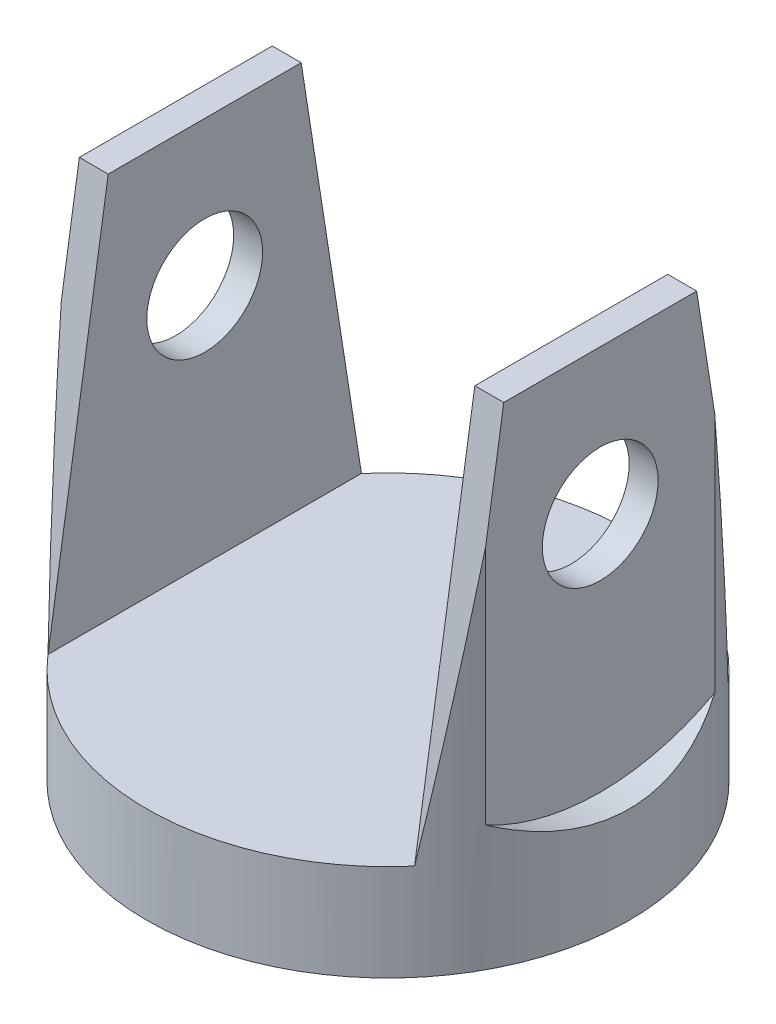
ISO-10303-21;
HEADER;
FILE_DESCRIPTION(('STEP AP214'),'2;1');
FILE_NAME('part.step','',(''),(''),'','','');
FILE_SCHEMA(('AUTOMOTIVE_DESIGN { 1 0 10303 214 1 1 1 1 }'));
ENDSEC;
DATA;
#1=APPLICATION_CONTEXT('core data for automotive mechanical design processes');
#2=APPLICATION_PROTOCOL_DEFINITION('international standard','automotive_design',2000,#1);
#3=PRODUCT_CONTEXT('',#1,'mechanical');
#4=PRODUCT('Part','Part','',(#3));
#5=PRODUCT_RELATED_PRODUCT_CATEGORY('part','',(#4));
#6=PRODUCT_DEFINITION_FORMATION('','',#4);
#7=PRODUCT_DEFINITION_CONTEXT('part definition',#1,'design');
#8=PRODUCT_DEFINITION('design','',#6,#7);
#9=PRODUCT_DEFINITION_SHAPE('','',#8);
#10=(LENGTH_UNIT() NAMED_UNIT(*) SI_UNIT(.MILLI.,.METRE.));
#11=(NAMED_UNIT(*) PLANE_ANGLE_UNIT() SI_UNIT($,.RADIAN.));
#12=(NAMED_UNIT(*) SI_UNIT($,.STERADIAN.) SOLID_ANGLE_UNIT());
#13=UNCERTAINTY_MEASURE_WITH_UNIT(LENGTH_MEASURE(1.E-05),#10,'distance_accuracy_value','');
#14=(GEOMETRIC_REPRESENTATION_CONTEXT(3) GLOBAL_UNCERTAINTY_ASSIGNED_CONTEXT((#13)) GLOBAL_UNIT_ASSIGNED_CONTEXT((#10,
#11,#12)) REPRESENTATION_CONTEXT('',''));
#15=CARTESIAN_POINT('',(0.,0.,0.));
#16=DIRECTION('',(0.,0.,1.));
#17=DIRECTION('',(1.,0.,0.));
#18=AXIS2_PLACEMENT_3D('',#15,#16,#17);
#19=CARTESIAN_POINT('',(0.,0.,0.));
#20=DIRECTION('',(0.,1.,0.));
#21=DIRECTION('',(0.,0.,1.));
#22=AXIS2_PLACEMENT_3D('',#19,#20,#21);
#23=PLANE('',#22);
#24=CARTESIAN_POINT('',(0.,0.,0.));
#25=DIRECTION('',(0.,1.,0.));
#26=DIRECTION('',(0.,0.,1.));
#27=AXIS2_PLACEMENT_3D('',#24,#25,#26);
#28=CIRCLE('',#27,125.);
#29=CARTESIAN_POINT('',(0.,0.,125.));
#30=VERTEX_POINT('',#29);
#31=EDGE_CURVE('E181',#30,#30,#28,.T.);
#32=ORIENTED_EDGE('',*,*,#31,.F.);
#33=EDGE_LOOP('',(#32));
#34=FACE_BOUND('',#33,.T.);
#35=CARTESIAN_POINT('',(0.,0.,0.));
#36=DIRECTION('',(0.,1.,0.));
#37=DIRECTION('',(0.,0.,1.));
#38=AXIS2_PLACEMENT_3D('',#35,#36,#37);
#39=CIRCLE('',#38,59.95);
#40=CARTESIAN_POINT('',(0.,0.,59.95));
#41=VERTEX_POINT('',#40);
#42=EDGE_CURVE('E11',#41,#41,#39,.F.);
#43=ORIENTED_EDGE('',*,*,#42,.F.);
#44=EDGE_LOOP('',(#43));
#45=FACE_BOUND('',#44,.T.);
#46=ADVANCED_FACE('F34',(#34,#45),#23,.F.);
#47=CARTESIAN_POINT('',(0.,250.,0.));
#48=DIRECTION('',(0.,1.,0.));
#49=DIRECTION('',(0.,0.,1.));
#50=AXIS2_PLACEMENT_3D('',#47,#48,#49);
#51=PLANE('',#50);
#52=DIRECTION('',(0.,0.,1.));
#53=VECTOR('',#52,1.);
#54=CARTESIAN_POINT('',(110.,250.,0.));
#55=LINE('',#54,#53);
#56=CARTESIAN_POINT('',(110.,250.,-50.));
#57=VERTEX_POINT('',#56);
#58=CARTESIAN_POINT('',(110.,250.,50.));
#59=VERTEX_POINT('',#58);
#60=EDGE_CURVE('E125',#57,#59,#55,.T.);
#61=ORIENTED_EDGE('',*,*,#60,.F.);
#62=DIRECTION('',(1.,0.,0.));
#63=VECTOR('',#62,1.);
#64=CARTESIAN_POINT('',(-125.,250.,-50.));
#65=LINE('',#64,#63);
#66=CARTESIAN_POINT('',(95.,250.,-50.));
#67=VERTEX_POINT('',#66);
#68=EDGE_CURVE('E155',#67,#57,#65,.T.);
#69=ORIENTED_EDGE('',*,*,#68,.F.);
#70=DIRECTION('',(0.,0.,-1.));
#71=VECTOR('',#70,1.);
#72=CARTESIAN_POINT('',(95.,250.,0.));
#73=LINE('',#72,#71);
#74=CARTESIAN_POINT('',(95.,250.,50.));
#75=VERTEX_POINT('',#74);
#76=EDGE_CURVE('E187',#75,#67,#73,.T.);
#77=ORIENTED_EDGE('',*,*,#76,.F.);
#78=DIRECTION('',(1.,0.,0.));
#79=VECTOR('',#78,1.);
#80=CARTESIAN_POINT('',(-125.,250.,50.));
#81=LINE('',#80,#79);
#82=EDGE_CURVE('E164',#75,#59,#81,.T.);
#83=ORIENTED_EDGE('',*,*,#82,.T.);
#84=EDGE_LOOP('',(#61,#69,#77,#83));
#85=FACE_BOUND('',#84,.T.);
#86=ADVANCED_FACE('F223',(#85),#51,.T.);
#87=CARTESIAN_POINT('',(0.,250.,0.));
#88=DIRECTION('',(0.,-1.,0.));
#89=DIRECTION('',(0.,0.,-1.));
#90=AXIS2_PLACEMENT_3D('',#87,#88,#89);
#91=CYLINDRICAL_SURFACE('',#90,125.);
#92=ORIENTED_EDGE('',*,*,#31,.T.);
#93=EDGE_LOOP('',(#92));
#94=FACE_BOUND('',#93,.T.);
#95=CARTESIAN_POINT('',(0.,570.098497674048,0.));
#96=DIRECTION('',(0.,0.154330508485288,-0.98801927822825));
#97=DIRECTION('',(0.,-0.98801927822825,-0.154330508485288));
#98=AXIS2_PLACEMENT_3D('',#95,#96,#97);
#99=ELLIPSE('',#98,809.950030145311,125.);
#100=CARTESIAN_POINT('',(110.,190.002591381192,-59.3717104351896));
#101=VERTEX_POINT('',#100);
#102=CARTESIAN_POINT('',(95.,50.,-81.2403840463596));
#103=VERTEX_POINT('',#102);
#104=EDGE_CURVE('E124',#101,#103,#99,.T.);
#105=ORIENTED_EDGE('',*,*,#104,.F.);
#106=DIRECTION('',(0.,-1.,0.));
#107=VECTOR('',#106,1.);
#108=CARTESIAN_POINT('',(110.,250.,-59.3717104351896));
#109=LINE('',#108,#107);
#110=CARTESIAN_POINT('',(110.,65.,-59.3717104351896));
#111=VERTEX_POINT('',#110);
#112=EDGE_CURVE('E49',#101,#111,#109,.T.);
#113=ORIENTED_EDGE('',*,*,#112,.T.);
#114=CARTESIAN_POINT('',(0.,175.,0.));
#115=DIRECTION('',(-0.707106781186547,-0.707106781186548,0.));
#116=DIRECTION('',(0.707106781186547,-0.707106781186548,0.));
#117=AXIS2_PLACEMENT_3D('',#114,#115,#116);
#118=ELLIPSE('',#117,176.776695296637,125.);
#119=CARTESIAN_POINT('',(110.,65.,59.3717104351896));
#120=VERTEX_POINT('',#119);
#121=EDGE_CURVE('E42',#120,#111,#118,.F.);
#122=ORIENTED_EDGE('',*,*,#121,.F.);
#123=DIRECTION('',(0.,-1.,0.));
#124=VECTOR('',#123,1.);
#125=CARTESIAN_POINT('',(110.,250.,59.3717104351896));
#126=LINE('',#125,#124);
#127=CARTESIAN_POINT('',(110.,190.002591381192,59.3717104351896));
#128=VERTEX_POINT('',#127);
#129=EDGE_CURVE('E118',#120,#128,#126,.F.);
#130=ORIENTED_EDGE('',*,*,#129,.T.);
#131=CARTESIAN_POINT('',(0.,570.098497674048,0.));
#132=DIRECTION('',(0.,-0.154330508485288,-0.98801927822825));
#133=DIRECTION('',(0.,-0.98801927822825,0.154330508485288));
#134=AXIS2_PLACEMENT_3D('',#131,#132,#133);
#135=ELLIPSE('',#134,809.950030145311,125.);
#136=CARTESIAN_POINT('',(95.,50.,81.2403840463596));
#137=VERTEX_POINT('',#136);
#138=EDGE_CURVE('E172',#128,#137,#135,.T.);
#139=ORIENTED_EDGE('',*,*,#138,.T.);
#140=CARTESIAN_POINT('',(0.,50.,0.));
#141=DIRECTION('',(0.,1.,0.));
#142=DIRECTION('',(0.,0.,1.));
#143=AXIS2_PLACEMENT_3D('',#140,#141,#142);
#144=CIRCLE('',#143,125.);
#145=CARTESIAN_POINT('',(-95.,50.,81.2403840463596));
#146=VERTEX_POINT('',#145);
#147=EDGE_CURVE('E190',#146,#137,#144,.T.);
#148=ORIENTED_EDGE('',*,*,#147,.F.);
#149=CARTESIAN_POINT('',(-110.,190.002591381192,59.3717104351896));
#150=VERTEX_POINT('',#149);
#151=EDGE_CURVE('E168',#146,#150,#135,.T.);
#152=ORIENTED_EDGE('',*,*,#151,.T.);
#153=DIRECTION('',(0.,-1.,0.));
#154=VECTOR('',#153,1.);
#155=CARTESIAN_POINT('',(-110.,250.,59.3717104351896));
#156=LINE('',#155,#154);
#157=CARTESIAN_POINT('',(-110.,65.,59.3717104351896));
#158=VERTEX_POINT('',#157);
#159=EDGE_CURVE('E148',#150,#158,#156,.T.);
#160=ORIENTED_EDGE('',*,*,#159,.T.);
#161=CARTESIAN_POINT('',(0.,175.,0.));
#162=DIRECTION('',(0.707106781186547,-0.707106781186548,0.));
#163=DIRECTION('',(-0.707106781186547,-0.707106781186548,0.));
#164=AXIS2_PLACEMENT_3D('',#161,#162,#163);
#165=ELLIPSE('',#164,176.776695296637,125.);
#166=CARTESIAN_POINT('',(-110.,65.,-59.3717104351896));
#167=VERTEX_POINT('',#166);
#168=EDGE_CURVE('E116',#167,#158,#165,.F.);
#169=ORIENTED_EDGE('',*,*,#168,.F.);
#170=DIRECTION('',(0.,-1.,0.));
#171=VECTOR('',#170,1.);
#172=CARTESIAN_POINT('',(-110.,250.,-59.3717104351896));
#173=LINE('',#172,#171);
#174=CARTESIAN_POINT('',(-110.,190.002591381192,-59.3717104351896));
#175=VERTEX_POINT('',#174);
#176=EDGE_CURVE('E142',#167,#175,#173,.F.);
#177=ORIENTED_EDGE('',*,*,#176,.T.);
#178=CARTESIAN_POINT('',(-95.,50.,-81.2403840463596));
#179=VERTEX_POINT('',#178);
#180=EDGE_CURVE('E159',#179,#175,#99,.T.);
#181=ORIENTED_EDGE('',*,*,#180,.F.);
#182=EDGE_CURVE('E193',#103,#179,#144,.T.);
#183=ORIENTED_EDGE('',*,*,#182,.F.);
#184=EDGE_LOOP('',(#105,#113,#122,#130,#139,#148,#152,#160,#169,#177,#181,#183));
#185=FACE_BOUND('',#184,.T.);
#186=ADVANCED_FACE('F36',(#94,#185),#91,.T.);
#187=DIRECTION('',(0.,0.,-1.));
#188=VECTOR('',#187,1.);
#189=CARTESIAN_POINT('',(-110.,250.,0.));
#190=LINE('',#189,#188);
#191=CARTESIAN_POINT('',(-110.,250.,50.));
#192=VERTEX_POINT('',#191);
#193=CARTESIAN_POINT('',(-110.,250.,-50.));
#194=VERTEX_POINT('',#193);
#195=EDGE_CURVE('E57',#192,#194,#190,.T.);
#196=ORIENTED_EDGE('',*,*,#195,.F.);
#197=CARTESIAN_POINT('',(-95.,250.,50.));
#198=VERTEX_POINT('',#197);
#199=EDGE_CURVE('E167',#192,#198,#81,.T.);
#200=ORIENTED_EDGE('',*,*,#199,.T.);
#201=DIRECTION('',(0.,0.,1.));
#202=VECTOR('',#201,1.);
#203=CARTESIAN_POINT('',(-95.,250.,0.));
#204=LINE('',#203,#202);
#205=CARTESIAN_POINT('',(-95.,250.,-50.));
#206=VERTEX_POINT('',#205);
#207=EDGE_CURVE('E184',#206,#198,#204,.T.);
#208=ORIENTED_EDGE('',*,*,#207,.F.);
#209=EDGE_CURVE('E158',#194,#206,#65,.T.);
#210=ORIENTED_EDGE('',*,*,#209,.F.);
#211=EDGE_LOOP('',(#196,#200,#208,#210));
#212=FACE_BOUND('',#211,.T.);
#213=ADVANCED_FACE('F230',(#212),#51,.T.);
#214=CARTESIAN_POINT('',(95.,50.,-125.));
#215=DIRECTION('',(1.,0.,0.));
#216=DIRECTION('',(0.,0.,-1.));
#217=AXIS2_PLACEMENT_3D('',#214,#215,#216);
#218=PLANE('',#217);
#219=CARTESIAN_POINT('',(95.,175.,0.));
#220=DIRECTION('',(1.,0.,0.));
#221=DIRECTION('',(0.,0.,-1.));
#222=AXIS2_PLACEMENT_3D('',#219,#220,#221);
#223=CIRCLE('',#222,30.);
#224=CARTESIAN_POINT('',(95.,175.,-30.));
#225=VERTEX_POINT('',#224);
#226=EDGE_CURVE('E152',#225,#225,#223,.T.);
#227=ORIENTED_EDGE('',*,*,#226,.T.);
#228=EDGE_LOOP('',(#227));
#229=FACE_BOUND('',#228,.T.);
#230=DIRECTION('',(0.,0.98801927822825,0.154330508485288));
#231=VECTOR('',#230,1.);
#232=CARTESIAN_POINT('',(95.,43.327467349698,-82.2826464591462));
#233=LINE('',#232,#231);
#234=EDGE_CURVE('E162',#103,#67,#233,.T.);
#235=ORIENTED_EDGE('',*,*,#234,.F.);
#236=DIRECTION('',(0.,0.,-1.));
#237=VECTOR('',#236,1.);
#238=CARTESIAN_POINT('',(95.,50.,-125.));
#239=LINE('',#238,#237);
#240=EDGE_CURVE('E175',#137,#103,#239,.T.);
#241=ORIENTED_EDGE('',*,*,#240,.F.);
#242=DIRECTION('',(0.,0.98801927822825,-0.154330508485288));
#243=VECTOR('',#242,1.);
#244=CARTESIAN_POINT('',(95.,81.4478467502562,76.3281699968143));
#245=LINE('',#244,#243);
#246=EDGE_CURVE('E171',#137,#75,#245,.T.);
#247=ORIENTED_EDGE('',*,*,#246,.T.);
#248=ORIENTED_EDGE('',*,*,#76,.T.);
#249=EDGE_LOOP('',(#235,#241,#247,#248));
#250=FACE_BOUND('',#249,.T.);
#251=ADVANCED_FACE('F234',(#229,#250),#218,.F.);
#252=CARTESIAN_POINT('',(-95.,50.,-125.));
#253=DIRECTION('',(-1.,0.,0.));
#254=DIRECTION('',(0.,0.,1.));
#255=AXIS2_PLACEMENT_3D('',#252,#253,#254);
#256=PLANE('',#255);
#257=CARTESIAN_POINT('',(-95.,175.,0.));
#258=DIRECTION('',(-1.,0.,0.));
#259=DIRECTION('',(0.,0.,1.));
#260=AXIS2_PLACEMENT_3D('',#257,#258,#259);
#261=CIRCLE('',#260,30.);
#262=CARTESIAN_POINT('',(-95.,175.,30.));
#263=VERTEX_POINT('',#262);
#264=EDGE_CURVE('E151',#263,#263,#261,.T.);
#265=ORIENTED_EDGE('',*,*,#264,.T.);
#266=EDGE_LOOP('',(#265));
#267=FACE_BOUND('',#266,.T.);
#268=DIRECTION('',(0.,-0.98801927822825,-0.154330508485288));
#269=VECTOR('',#268,1.);
#270=CARTESIAN_POINT('',(-95.,43.327467349698,-82.2826464591462));
#271=LINE('',#270,#269);
#272=EDGE_CURVE('E197',#206,#179,#271,.T.);
#273=ORIENTED_EDGE('',*,*,#272,.F.);
#274=ORIENTED_EDGE('',*,*,#207,.T.);
#275=DIRECTION('',(0.,-0.98801927822825,0.154330508485288));
#276=VECTOR('',#275,1.);
#277=CARTESIAN_POINT('',(-95.,81.4478467502562,76.3281699968143));
#278=LINE('',#277,#276);
#279=EDGE_CURVE('E194',#198,#146,#278,.T.);
#280=ORIENTED_EDGE('',*,*,#279,.T.);
#281=DIRECTION('',(0.,0.,1.));
#282=VECTOR('',#281,1.);
#283=CARTESIAN_POINT('',(-95.,50.,-125.));
#284=LINE('',#283,#282);
#285=EDGE_CURVE('E178',#179,#146,#284,.T.);
#286=ORIENTED_EDGE('',*,*,#285,.F.);
#287=EDGE_LOOP('',(#273,#274,#280,#286));
#288=FACE_BOUND('',#287,.T.);
#289=ADVANCED_FACE('F237',(#267,#288),#256,.F.);
#290=CARTESIAN_POINT('',(0.,50.,0.));
#291=DIRECTION('',(0.,1.,0.));
#292=DIRECTION('',(0.,0.,1.));
#293=AXIS2_PLACEMENT_3D('',#290,#291,#292);
#294=PLANE('',#293);
#295=ORIENTED_EDGE('',*,*,#182,.T.);
#296=ORIENTED_EDGE('',*,*,#285,.T.);
#297=ORIENTED_EDGE('',*,*,#147,.T.);
#298=ORIENTED_EDGE('',*,*,#240,.T.);
#299=EDGE_LOOP('',(#295,#296,#297,#298));
#300=FACE_BOUND('',#299,.T.);
#301=ADVANCED_FACE('F241',(#300),#294,.T.);
#302=CARTESIAN_POINT('',(-125.,13.5785523424435,86.9294841080919));
#303=DIRECTION('',(0.,-0.154330508485288,-0.98801927822825));
#304=DIRECTION('',(0.,0.98801927822825,-0.154330508485288));
#305=AXIS2_PLACEMENT_3D('',#302,#303,#304);
#306=PLANE('',#305);
#307=ORIENTED_EDGE('',*,*,#199,.F.);
#308=DIRECTION('',(0.,-0.98801927822825,0.154330508485288));
#309=VECTOR('',#308,1.);
#310=CARTESIAN_POINT('',(-110.,13.5785523424435,86.9294841080919));
#311=LINE('',#310,#309);
#312=EDGE_CURVE('E145',#192,#150,#311,.T.);
#313=ORIENTED_EDGE('',*,*,#312,.T.);
#314=ORIENTED_EDGE('',*,*,#151,.F.);
#315=ORIENTED_EDGE('',*,*,#279,.F.);
#316=EDGE_LOOP('',(#307,#313,#314,#315));
#317=FACE_BOUND('',#316,.T.);
#318=ADVANCED_FACE('F245',(#317),#306,.F.);
#319=ORIENTED_EDGE('',*,*,#138,.F.);
#320=DIRECTION('',(0.,0.98801927822825,-0.154330508485288));
#321=VECTOR('',#320,1.);
#322=CARTESIAN_POINT('',(110.,13.5785523424435,86.9294841080919));
#323=LINE('',#322,#321);
#324=EDGE_CURVE('E128',#128,#59,#323,.T.);
#325=ORIENTED_EDGE('',*,*,#324,.T.);
#326=ORIENTED_EDGE('',*,*,#82,.F.);
#327=ORIENTED_EDGE('',*,*,#246,.F.);
#328=EDGE_LOOP('',(#319,#325,#326,#327));
#329=FACE_BOUND('',#328,.T.);
#330=ADVANCED_FACE('F247',(#329),#306,.F.);
#331=CARTESIAN_POINT('',(-125.,13.5785523424435,-86.9294841080919));
#332=DIRECTION('',(0.,0.154330508485288,-0.98801927822825));
#333=DIRECTION('',(0.,0.98801927822825,0.154330508485288));
#334=AXIS2_PLACEMENT_3D('',#331,#332,#333);
#335=PLANE('',#334);
#336=DIRECTION('',(0.,-0.98801927822825,-0.154330508485288));
#337=VECTOR('',#336,1.);
#338=CARTESIAN_POINT('',(-110.,13.5785523424435,-86.9294841080919));
#339=LINE('',#338,#337);
#340=EDGE_CURVE('E139',#194,#175,#339,.T.);
#341=ORIENTED_EDGE('',*,*,#340,.F.);
#342=ORIENTED_EDGE('',*,*,#209,.T.);
#343=ORIENTED_EDGE('',*,*,#272,.T.);
#344=ORIENTED_EDGE('',*,*,#180,.T.);
#345=EDGE_LOOP('',(#341,#342,#343,#344));
#346=FACE_BOUND('',#345,.T.);
#347=ADVANCED_FACE('F250',(#346),#335,.T.);
#348=DIRECTION('',(0.,0.98801927822825,0.154330508485288));
#349=VECTOR('',#348,1.);
#350=CARTESIAN_POINT('',(110.,13.5785523424435,-86.9294841080919));
#351=LINE('',#350,#349);
#352=EDGE_CURVE('E126',#101,#57,#351,.T.);
#353=ORIENTED_EDGE('',*,*,#352,.F.);
#354=ORIENTED_EDGE('',*,*,#104,.T.);
#355=ORIENTED_EDGE('',*,*,#234,.T.);
#356=ORIENTED_EDGE('',*,*,#68,.T.);
#357=EDGE_LOOP('',(#353,#354,#355,#356));
#358=FACE_BOUND('',#357,.T.);
#359=ADVANCED_FACE('F252',(#358),#335,.T.);
#360=CARTESIAN_POINT('',(-125.,175.,0.));
#361=DIRECTION('',(1.,0.,0.));
#362=DIRECTION('',(0.,0.,-1.));
#363=AXIS2_PLACEMENT_3D('',#360,#361,#362);
#364=CYLINDRICAL_SURFACE('',#363,30.);
#365=CARTESIAN_POINT('',(-110.,175.,0.));
#366=DIRECTION('',(1.,0.,0.));
#367=DIRECTION('',(0.,0.,-1.));
#368=AXIS2_PLACEMENT_3D('',#365,#366,#367);
#369=CIRCLE('',#368,30.);
#370=CARTESIAN_POINT('',(-110.,175.,-30.));
#371=VERTEX_POINT('',#370);
#372=EDGE_CURVE('E138',#371,#371,#369,.F.);
#373=ORIENTED_EDGE('',*,*,#372,.T.);
#374=EDGE_LOOP('',(#373));
#375=FACE_BOUND('',#374,.T.);
#376=ORIENTED_EDGE('',*,*,#264,.F.);
#377=EDGE_LOOP('',(#376));
#378=FACE_BOUND('',#377,.T.);
#379=ADVANCED_FACE('F255',(#375,#378),#364,.F.);
#380=CARTESIAN_POINT('',(110.,175.,0.));
#381=DIRECTION('',(-1.,0.,0.));
#382=DIRECTION('',(0.,0.,1.));
#383=AXIS2_PLACEMENT_3D('',#380,#381,#382);
#384=CIRCLE('',#383,30.);
#385=CARTESIAN_POINT('',(110.,175.,30.));
#386=VERTEX_POINT('',#385);
#387=EDGE_CURVE('E119',#386,#386,#384,.F.);
#388=ORIENTED_EDGE('',*,*,#387,.T.);
#389=EDGE_LOOP('',(#388));
#390=FACE_BOUND('',#389,.T.);
#391=ORIENTED_EDGE('',*,*,#226,.F.);
#392=EDGE_LOOP('',(#391));
#393=FACE_BOUND('',#392,.T.);
#394=ADVANCED_FACE('F207',(#390,#393),#364,.F.);
#395=CARTESIAN_POINT('',(-110.,175.,0.));
#396=DIRECTION('',(-1.,0.,0.));
#397=DIRECTION('',(0.,0.,1.));
#398=AXIS2_PLACEMENT_3D('',#395,#396,#397);
#399=CYLINDRICAL_SURFACE('',#398,125.);
#400=ORIENTED_EDGE('',*,*,#168,.T.);
#401=CARTESIAN_POINT('',(-110.,175.,0.));
#402=DIRECTION('',(1.,0.,0.));
#403=DIRECTION('',(0.,0.,-1.));
#404=AXIS2_PLACEMENT_3D('',#401,#402,#403);
#405=CIRCLE('',#404,125.);
#406=EDGE_CURVE('E135',#158,#167,#405,.T.);
#407=ORIENTED_EDGE('',*,*,#406,.T.);
#408=EDGE_LOOP('',(#400,#407));
#409=FACE_BOUND('',#408,.T.);
#410=ADVANCED_FACE('F260',(#409),#399,.F.);
#411=CARTESIAN_POINT('',(-110.,175.,0.));
#412=DIRECTION('',(1.,0.,0.));
#413=DIRECTION('',(0.,0.,-1.));
#414=AXIS2_PLACEMENT_3D('',#411,#412,#413);
#415=PLANE('',#414);
#416=ORIENTED_EDGE('',*,*,#372,.F.);
#417=EDGE_LOOP('',(#416));
#418=FACE_BOUND('',#417,.T.);
#419=ORIENTED_EDGE('',*,*,#312,.F.);
#420=ORIENTED_EDGE('',*,*,#195,.T.);
#421=ORIENTED_EDGE('',*,*,#340,.T.);
#422=ORIENTED_EDGE('',*,*,#176,.F.);
#423=ORIENTED_EDGE('',*,*,#406,.F.);
#424=ORIENTED_EDGE('',*,*,#159,.F.);
#425=EDGE_LOOP('',(#419,#420,#421,#422,#423,#424));
#426=FACE_BOUND('',#425,.T.);
#427=ADVANCED_FACE('F220',(#418,#426),#415,.F.);
#428=CARTESIAN_POINT('',(110.,175.,0.));
#429=DIRECTION('',(1.,0.,0.));
#430=DIRECTION('',(0.,0.,-1.));
#431=AXIS2_PLACEMENT_3D('',#428,#429,#430);
#432=CYLINDRICAL_SURFACE('',#431,125.);
#433=ORIENTED_EDGE('',*,*,#121,.T.);
#434=CARTESIAN_POINT('',(110.,175.,0.));
#435=DIRECTION('',(-1.,0.,0.));
#436=DIRECTION('',(0.,0.,1.));
#437=AXIS2_PLACEMENT_3D('',#434,#435,#436);
#438=CIRCLE('',#437,125.);
#439=EDGE_CURVE('E113',#111,#120,#438,.T.);
#440=ORIENTED_EDGE('',*,*,#439,.T.);
#441=EDGE_LOOP('',(#433,#440));
#442=FACE_BOUND('',#441,.T.);
#443=ADVANCED_FACE('F112',(#442),#432,.F.);
#444=CARTESIAN_POINT('',(110.,175.,0.));
#445=DIRECTION('',(-1.,0.,0.));
#446=DIRECTION('',(0.,0.,1.));
#447=AXIS2_PLACEMENT_3D('',#444,#445,#446);
#448=PLANE('',#447);
#449=ORIENTED_EDGE('',*,*,#387,.F.);
#450=EDGE_LOOP('',(#449));
#451=FACE_BOUND('',#450,.T.);
#452=ORIENTED_EDGE('',*,*,#439,.F.);
#453=ORIENTED_EDGE('',*,*,#112,.F.);
#454=ORIENTED_EDGE('',*,*,#352,.T.);
#455=ORIENTED_EDGE('',*,*,#60,.T.);
#456=ORIENTED_EDGE('',*,*,#324,.F.);
#457=ORIENTED_EDGE('',*,*,#129,.F.);
#458=EDGE_LOOP('',(#452,#453,#454,#455,#456,#457));
#459=FACE_BOUND('',#458,.T.);
#460=ADVANCED_FACE('F117',(#451,#459),#448,.F.);
#461=CARTESIAN_POINT('',(0.,-20.,0.));
#462=DIRECTION('',(0.,1.,0.));
#463=DIRECTION('',(0.,0.,1.));
#464=AXIS2_PLACEMENT_3D('',#461,#462,#463);
#465=CYLINDRICAL_SURFACE('',#464,59.95);
#466=CARTESIAN_POINT('',(0.,-20.,0.));
#467=DIRECTION('',(0.,-1.,0.));
#468=DIRECTION('',(0.,0.,-1.));
#469=AXIS2_PLACEMENT_3D('',#466,#467,#468);
#470=CIRCLE('',#469,59.95);
#471=CARTESIAN_POINT('',(0.,-20.,-59.95));
#472=VERTEX_POINT('',#471);
#473=EDGE_CURVE('E120',#472,#472,#470,.T.);
#474=ORIENTED_EDGE('',*,*,#473,.F.);
#475=EDGE_LOOP('',(#474));
#476=FACE_BOUND('',#475,.T.);
#477=ORIENTED_EDGE('',*,*,#42,.T.);
#478=EDGE_LOOP('',(#477));
#479=FACE_BOUND('',#478,.T.);
#480=ADVANCED_FACE('F211',(#476,#479),#465,.T.);
#481=CARTESIAN_POINT('',(0.,-20.,0.));
#482=DIRECTION('',(0.,-1.,0.));
#483=DIRECTION('',(0.,0.,-1.));
#484=AXIS2_PLACEMENT_3D('',#481,#482,#483);
#485=PLANE('',#484);
#486=ORIENTED_EDGE('',*,*,#473,.T.);
#487=EDGE_LOOP('',(#486));
#488=FACE_BOUND('',#487,.T.);
#489=ADVANCED_FACE('F217',(#488),#485,.T.);
#490=CLOSED_SHELL('',(#46,#86,#186,#213,#251,#289,#301,#318,#330,#347,#359,#379,#394,#410,#427,
#443,#460,#480,#489));
#491=MANIFOLD_SOLID_BREP('B2',#490);
#492=ADVANCED_BREP_SHAPE_REPRESENTATION('',(#18,#491),#14);
#493=SHAPE_DEFINITION_REPRESENTATION(#9,#492);
ENDSEC;
END-ISO-10303-21;
